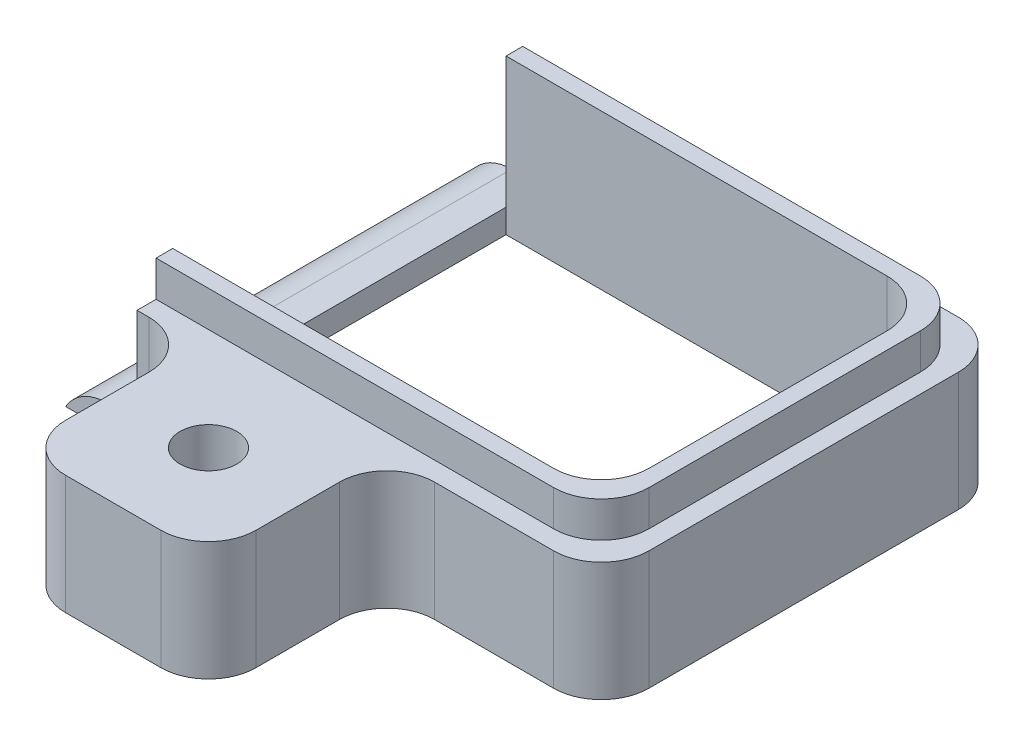
ISO-10303-21;
HEADER;
FILE_DESCRIPTION(('STEP AP214'),'2;1');
FILE_NAME('part.step','',(''),(''),'','','');
FILE_SCHEMA(('AUTOMOTIVE_DESIGN { 1 0 10303 214 1 1 1 1 }'));
ENDSEC;
DATA;
#1=APPLICATION_CONTEXT('core data for automotive mechanical design processes');
#2=APPLICATION_PROTOCOL_DEFINITION('international standard','automotive_design',2000,#1);
#3=PRODUCT_CONTEXT('',#1,'mechanical');
#4=PRODUCT('Part','Part','',(#3));
#5=PRODUCT_RELATED_PRODUCT_CATEGORY('part','',(#4));
#6=PRODUCT_DEFINITION_FORMATION('','',#4);
#7=PRODUCT_DEFINITION_CONTEXT('part definition',#1,'design');
#8=PRODUCT_DEFINITION('design','',#6,#7);
#9=PRODUCT_DEFINITION_SHAPE('','',#8);
#10=(LENGTH_UNIT() NAMED_UNIT(*) SI_UNIT(.MILLI.,.METRE.));
#11=(NAMED_UNIT(*) PLANE_ANGLE_UNIT() SI_UNIT($,.RADIAN.));
#12=(NAMED_UNIT(*) SI_UNIT($,.STERADIAN.) SOLID_ANGLE_UNIT());
#13=UNCERTAINTY_MEASURE_WITH_UNIT(LENGTH_MEASURE(1.E-05),#10,'distance_accuracy_value','');
#14=(GEOMETRIC_REPRESENTATION_CONTEXT(3) GLOBAL_UNCERTAINTY_ASSIGNED_CONTEXT((#13)) GLOBAL_UNIT_ASSIGNED_CONTEXT((#10,
#11,#12)) REPRESENTATION_CONTEXT('',''));
#15=CARTESIAN_POINT('',(0.,0.,0.));
#16=DIRECTION('',(0.,0.,1.));
#17=DIRECTION('',(1.,0.,0.));
#18=AXIS2_PLACEMENT_3D('',#15,#16,#17);
#19=CARTESIAN_POINT('',(5.62499999999999,2.5,-4.25));
#20=DIRECTION('',(0.,-1.,0.));
#21=DIRECTION('',(0.,0.,-1.));
#22=AXIS2_PLACEMENT_3D('',#19,#20,#21);
#23=PLANE('',#22);
#24=CARTESIAN_POINT('',(-0.875000000000002,2.5,6.));
#25=DIRECTION('',(0.,1.,0.));
#26=DIRECTION('',(0.,0.,1.));
#27=AXIS2_PLACEMENT_3D('',#24,#25,#26);
#28=CIRCLE('',#27,0.595629999999989);
#29=CARTESIAN_POINT('',(-0.875000000000002,2.5,6.59562999999999));
#30=VERTEX_POINT('',#29);
#31=EDGE_CURVE('E517',#30,#30,#28,.T.);
#32=ORIENTED_EDGE('',*,*,#31,.F.);
#33=EDGE_LOOP('',(#32));
#34=FACE_BOUND('',#33,.T.);
#35=DIRECTION('',(0.,0.,-1.));
#36=VECTOR('',#35,1.);
#37=CARTESIAN_POINT('',(5.625,2.5,4.25));
#38=LINE('',#37,#36);
#39=CARTESIAN_POINT('',(5.625,2.5,3.25));
#40=VERTEX_POINT('',#39);
#41=CARTESIAN_POINT('',(5.625,2.5,-3.25));
#42=VERTEX_POINT('',#41);
#43=EDGE_CURVE('E309',#40,#42,#38,.T.);
#44=ORIENTED_EDGE('',*,*,#43,.T.);
#45=CARTESIAN_POINT('',(4.625,2.5,-3.25));
#46=DIRECTION('',(0.,-1.,0.));
#47=DIRECTION('',(0.,0.,-1.));
#48=AXIS2_PLACEMENT_3D('',#45,#46,#47);
#49=CIRCLE('',#48,1.);
#50=CARTESIAN_POINT('',(4.62499999999999,2.5,-4.25));
#51=VERTEX_POINT('',#50);
#52=EDGE_CURVE('E368',#42,#51,#49,.F.);
#53=ORIENTED_EDGE('',*,*,#52,.T.);
#54=DIRECTION('',(-1.,0.,0.));
#55=VECTOR('',#54,1.);
#56=CARTESIAN_POINT('',(-5.625,2.5,-4.25));
#57=LINE('',#56,#55);
#58=CARTESIAN_POINT('',(-4.125,2.5,-4.25));
#59=VERTEX_POINT('',#58);
#60=EDGE_CURVE('E312',#51,#59,#57,.T.);
#61=ORIENTED_EDGE('',*,*,#60,.T.);
#62=DIRECTION('',(0.,0.,-1.));
#63=VECTOR('',#62,1.);
#64=CARTESIAN_POINT('',(-4.125,2.5,-4.25));
#65=LINE('',#64,#63);
#66=CARTESIAN_POINT('',(-4.125,2.5,-3.85));
#67=VERTEX_POINT('',#66);
#68=EDGE_CURVE('E295',#67,#59,#65,.T.);
#69=ORIENTED_EDGE('',*,*,#68,.F.);
#70=DIRECTION('',(-1.,0.,0.));
#71=VECTOR('',#70,1.);
#72=CARTESIAN_POINT('',(5.225,2.5,-3.85));
#73=LINE('',#72,#71);
#74=CARTESIAN_POINT('',(4.225,2.5,-3.85));
#75=VERTEX_POINT('',#74);
#76=EDGE_CURVE('E266',#75,#67,#73,.T.);
#77=ORIENTED_EDGE('',*,*,#76,.F.);
#78=CARTESIAN_POINT('',(4.225,2.5,-2.85));
#79=DIRECTION('',(0.,-1.,0.));
#80=DIRECTION('',(0.,0.,-1.));
#81=AXIS2_PLACEMENT_3D('',#78,#79,#80);
#82=CIRCLE('',#81,1.);
#83=CARTESIAN_POINT('',(5.225,2.5,-2.85));
#84=VERTEX_POINT('',#83);
#85=EDGE_CURVE('E416',#75,#84,#82,.T.);
#86=ORIENTED_EDGE('',*,*,#85,.T.);
#87=DIRECTION('',(0.,0.,-1.));
#88=VECTOR('',#87,1.);
#89=CARTESIAN_POINT('',(5.225,2.5,3.85));
#90=LINE('',#89,#88);
#91=CARTESIAN_POINT('',(5.225,2.5,2.85));
#92=VERTEX_POINT('',#91);
#93=EDGE_CURVE('E263',#92,#84,#90,.T.);
#94=ORIENTED_EDGE('',*,*,#93,.F.);
#95=CARTESIAN_POINT('',(4.225,2.5,2.85));
#96=DIRECTION('',(0.,-1.,0.));
#97=DIRECTION('',(0.,0.,-1.));
#98=AXIS2_PLACEMENT_3D('',#95,#96,#97);
#99=CIRCLE('',#98,1.);
#100=CARTESIAN_POINT('',(4.225,2.5,3.85));
#101=VERTEX_POINT('',#100);
#102=EDGE_CURVE('E418',#92,#101,#99,.T.);
#103=ORIENTED_EDGE('',*,*,#102,.T.);
#104=DIRECTION('',(1.,0.,0.));
#105=VECTOR('',#104,1.);
#106=CARTESIAN_POINT('',(-4.125,2.5,3.85));
#107=LINE('',#106,#105);
#108=CARTESIAN_POINT('',(-4.125,2.5,3.85));
#109=VERTEX_POINT('',#108);
#110=EDGE_CURVE('E267',#109,#101,#107,.T.);
#111=ORIENTED_EDGE('',*,*,#110,.F.);
#112=CARTESIAN_POINT('',(-4.125,2.5,4.25));
#113=VERTEX_POINT('',#112);
#114=EDGE_CURVE('E291',#113,#109,#65,.T.);
#115=ORIENTED_EDGE('',*,*,#114,.F.);
#116=DIRECTION('',(1.,0.,0.));
#117=VECTOR('',#116,1.);
#118=CARTESIAN_POINT('',(-5.625,2.5,4.25));
#119=LINE('',#118,#117);
#120=CARTESIAN_POINT('',(-3.875,2.5,4.25));
#121=VERTEX_POINT('',#120);
#122=EDGE_CURVE('E322',#113,#121,#119,.T.);
#123=ORIENTED_EDGE('',*,*,#122,.T.);
#124=CARTESIAN_POINT('',(-3.875,2.5,5.25));
#125=DIRECTION('',(0.,-1.,0.));
#126=DIRECTION('',(0.,0.,-1.));
#127=AXIS2_PLACEMENT_3D('',#124,#125,#126);
#128=CIRCLE('',#127,1.);
#129=CARTESIAN_POINT('',(-2.875,2.5,5.25));
#130=VERTEX_POINT('',#129);
#131=EDGE_CURVE('E426',#121,#130,#128,.T.);
#132=ORIENTED_EDGE('',*,*,#131,.T.);
#133=DIRECTION('',(0.,0.,-1.));
#134=VECTOR('',#133,1.);
#135=CARTESIAN_POINT('',(-2.875,2.5,8.));
#136=LINE('',#135,#134);
#137=CARTESIAN_POINT('',(-2.875,2.5,7.));
#138=VERTEX_POINT('',#137);
#139=EDGE_CURVE('E278',#138,#130,#136,.T.);
#140=ORIENTED_EDGE('',*,*,#139,.F.);
#141=CARTESIAN_POINT('',(-1.875,2.5,7.));
#142=DIRECTION('',(0.,-1.,0.));
#143=DIRECTION('',(0.,0.,-1.));
#144=AXIS2_PLACEMENT_3D('',#141,#142,#143);
#145=CIRCLE('',#144,1.);
#146=CARTESIAN_POINT('',(-1.875,2.5,8.));
#147=VERTEX_POINT('',#146);
#148=EDGE_CURVE('E359',#138,#147,#145,.F.);
#149=ORIENTED_EDGE('',*,*,#148,.T.);
#150=DIRECTION('',(-1.,0.,0.));
#151=VECTOR('',#150,1.);
#152=CARTESIAN_POINT('',(-2.875,2.5,8.));
#153=LINE('',#152,#151);
#154=CARTESIAN_POINT('',(0.124999999999998,2.5,8.));
#155=VERTEX_POINT('',#154);
#156=EDGE_CURVE('E283',#155,#147,#153,.T.);
#157=ORIENTED_EDGE('',*,*,#156,.F.);
#158=CARTESIAN_POINT('',(0.124999999999998,2.5,7.));
#159=DIRECTION('',(0.,-1.,0.));
#160=DIRECTION('',(0.,0.,-1.));
#161=AXIS2_PLACEMENT_3D('',#158,#159,#160);
#162=CIRCLE('',#161,1.);
#163=CARTESIAN_POINT('',(1.125,2.5,7.));
#164=VERTEX_POINT('',#163);
#165=EDGE_CURVE('E357',#155,#164,#162,.F.);
#166=ORIENTED_EDGE('',*,*,#165,.T.);
#167=DIRECTION('',(0.,0.,-1.));
#168=VECTOR('',#167,1.);
#169=CARTESIAN_POINT('',(1.125,2.5,8.));
#170=LINE('',#169,#168);
#171=CARTESIAN_POINT('',(1.125,2.5,5.25));
#172=VERTEX_POINT('',#171);
#173=EDGE_CURVE('E282',#164,#172,#170,.T.);
#174=ORIENTED_EDGE('',*,*,#173,.T.);
#175=CARTESIAN_POINT('',(2.125,2.5,5.25));
#176=DIRECTION('',(0.,-1.,0.));
#177=DIRECTION('',(0.,0.,-1.));
#178=AXIS2_PLACEMENT_3D('',#175,#176,#177);
#179=CIRCLE('',#178,1.);
#180=CARTESIAN_POINT('',(2.125,2.5,4.25));
#181=VERTEX_POINT('',#180);
#182=EDGE_CURVE('E420',#172,#181,#179,.T.);
#183=ORIENTED_EDGE('',*,*,#182,.T.);
#184=CARTESIAN_POINT('',(4.62499999999999,2.5,4.25));
#185=VERTEX_POINT('',#184);
#186=EDGE_CURVE('E315',#181,#185,#119,.T.);
#187=ORIENTED_EDGE('',*,*,#186,.T.);
#188=CARTESIAN_POINT('',(4.625,2.5,3.25));
#189=DIRECTION('',(0.,-1.,0.));
#190=DIRECTION('',(0.,0.,-1.));
#191=AXIS2_PLACEMENT_3D('',#188,#189,#190);
#192=CIRCLE('',#191,1.);
#193=EDGE_CURVE('E364',#185,#40,#192,.F.);
#194=ORIENTED_EDGE('',*,*,#193,.T.);
#195=EDGE_LOOP('',(#44,#53,#61,#69,#77,#86,#94,#103,#111,#115,#123,#132,#140,#149,#157,#166,
#174,#183,#187,#194));
#196=FACE_BOUND('',#195,.T.);
#197=ADVANCED_FACE('F31',(#34,#196),#23,.F.);
#198=CARTESIAN_POINT('',(-5.625,2.5,4.25));
#199=DIRECTION('',(0.,0.,-1.));
#200=DIRECTION('',(-1.,0.,0.));
#201=AXIS2_PLACEMENT_3D('',#198,#199,#200);
#202=PLANE('',#201);
#203=DIRECTION('',(1.,0.,0.));
#204=VECTOR('',#203,1.);
#205=CARTESIAN_POINT('',(-5.625,0.5,4.25));
#206=LINE('',#205,#204);
#207=CARTESIAN_POINT('',(-4.75897459621556,0.5,4.25));
#208=VERTEX_POINT('',#207);
#209=CARTESIAN_POINT('',(-4.125,0.5,4.25));
#210=VERTEX_POINT('',#209);
#211=EDGE_CURVE('E294',#208,#210,#206,.T.);
#212=ORIENTED_EDGE('',*,*,#211,.F.);
#213=CARTESIAN_POINT('',(-4.75897459621556,-0.5,4.25));
#214=DIRECTION('',(0.,0.,-1.));
#215=DIRECTION('',(-1.,0.,0.));
#216=AXIS2_PLACEMENT_3D('',#213,#214,#215);
#217=CIRCLE('',#216,1.);
#218=CARTESIAN_POINT('',(-5.625,0.,4.25));
#219=VERTEX_POINT('',#218);
#220=EDGE_CURVE('E39',#208,#219,#217,.F.);
#221=ORIENTED_EDGE('',*,*,#220,.T.);
#222=DIRECTION('',(1.,0.,0.));
#223=VECTOR('',#222,1.);
#224=CARTESIAN_POINT('',(-5.625,0.,4.25));
#225=LINE('',#224,#223);
#226=CARTESIAN_POINT('',(-3.875,0.,4.25));
#227=VERTEX_POINT('',#226);
#228=EDGE_CURVE('E313',#219,#227,#225,.T.);
#229=ORIENTED_EDGE('',*,*,#228,.T.);
#230=DIRECTION('',(0.,-1.,0.));
#231=VECTOR('',#230,1.);
#232=CARTESIAN_POINT('',(-3.875,2.5,4.25));
#233=LINE('',#232,#231);
#234=EDGE_CURVE('E404',#227,#121,#233,.F.);
#235=ORIENTED_EDGE('',*,*,#234,.T.);
#236=ORIENTED_EDGE('',*,*,#122,.F.);
#237=DIRECTION('',(0.,1.,0.));
#238=VECTOR('',#237,1.);
#239=CARTESIAN_POINT('',(-4.125,0.5,4.25));
#240=LINE('',#239,#238);
#241=EDGE_CURVE('E307',#210,#113,#240,.T.);
#242=ORIENTED_EDGE('',*,*,#241,.F.);
#243=EDGE_LOOP('',(#212,#221,#229,#235,#236,#242));
#244=FACE_BOUND('',#243,.T.);
#245=ADVANCED_FACE('F439',(#244),#202,.F.);
#246=CARTESIAN_POINT('',(2.125,0.,4.25));
#247=VERTEX_POINT('',#246);
#248=CARTESIAN_POINT('',(4.62499999999999,0.,4.25));
#249=VERTEX_POINT('',#248);
#250=EDGE_CURVE('E330',#247,#249,#225,.T.);
#251=ORIENTED_EDGE('',*,*,#250,.T.);
#252=DIRECTION('',(0.,-1.,0.));
#253=VECTOR('',#252,1.);
#254=CARTESIAN_POINT('',(4.625,2.5,4.25));
#255=LINE('',#254,#253);
#256=EDGE_CURVE('E384',#249,#185,#255,.F.);
#257=ORIENTED_EDGE('',*,*,#256,.T.);
#258=ORIENTED_EDGE('',*,*,#186,.F.);
#259=DIRECTION('',(0.,1.,0.));
#260=VECTOR('',#259,1.);
#261=CARTESIAN_POINT('',(2.125,0.,4.25));
#262=LINE('',#261,#260);
#263=EDGE_CURVE('E382',#181,#247,#262,.F.);
#264=ORIENTED_EDGE('',*,*,#263,.T.);
#265=EDGE_LOOP('',(#251,#257,#258,#264));
#266=FACE_BOUND('',#265,.T.);
#267=ADVANCED_FACE('F568',(#266),#202,.F.);
#268=CARTESIAN_POINT('',(-4.125,0.5,-4.25));
#269=DIRECTION('',(1.,0.,0.));
#270=DIRECTION('',(0.,0.,-1.));
#271=AXIS2_PLACEMENT_3D('',#268,#269,#270);
#272=PLANE('',#271);
#273=ORIENTED_EDGE('',*,*,#114,.T.);
#274=DIRECTION('',(0.,-1.,0.));
#275=VECTOR('',#274,1.);
#276=CARTESIAN_POINT('',(-4.125,3.25,3.85));
#277=LINE('',#276,#275);
#278=CARTESIAN_POINT('',(-4.125,3.25,3.85));
#279=VERTEX_POINT('',#278);
#280=EDGE_CURVE('E248',#279,#109,#277,.T.);
#281=ORIENTED_EDGE('',*,*,#280,.F.);
#282=DIRECTION('',(0.,0.,1.));
#283=VECTOR('',#282,1.);
#284=CARTESIAN_POINT('',(-4.125,3.25,3.5));
#285=LINE('',#284,#283);
#286=CARTESIAN_POINT('',(-4.125,3.25,3.5));
#287=VERTEX_POINT('',#286);
#288=EDGE_CURVE('E226',#287,#279,#285,.T.);
#289=ORIENTED_EDGE('',*,*,#288,.F.);
#290=DIRECTION('',(0.,1.,0.));
#291=VECTOR('',#290,1.);
#292=CARTESIAN_POINT('',(-4.125,0.,3.5));
#293=LINE('',#292,#291);
#294=CARTESIAN_POINT('',(-4.125,0.5,3.5));
#295=VERTEX_POINT('',#294);
#296=EDGE_CURVE('E236',#295,#287,#293,.T.);
#297=ORIENTED_EDGE('',*,*,#296,.F.);
#298=DIRECTION('',(0.,0.,-1.));
#299=VECTOR('',#298,1.);
#300=CARTESIAN_POINT('',(-4.125,0.5,-4.25));
#301=LINE('',#300,#299);
#302=EDGE_CURVE('E475',#210,#295,#301,.T.);
#303=ORIENTED_EDGE('',*,*,#302,.F.);
#304=ORIENTED_EDGE('',*,*,#241,.T.);
#305=EDGE_LOOP('',(#273,#281,#289,#297,#303,#304));
#306=FACE_BOUND('',#305,.T.);
#307=ADVANCED_FACE('F246',(#306),#272,.F.);
#308=CARTESIAN_POINT('',(5.625,2.5,4.25));
#309=DIRECTION('',(-1.,0.,0.));
#310=DIRECTION('',(0.,0.,1.));
#311=AXIS2_PLACEMENT_3D('',#308,#309,#310);
#312=PLANE('',#311);
#313=DIRECTION('',(0.,0.,-1.));
#314=VECTOR('',#313,1.);
#315=CARTESIAN_POINT('',(5.625,0.,4.25));
#316=LINE('',#315,#314);
#317=CARTESIAN_POINT('',(5.625,0.,3.25));
#318=VERTEX_POINT('',#317);
#319=CARTESIAN_POINT('',(5.625,0.,-3.25));
#320=VERTEX_POINT('',#319);
#321=EDGE_CURVE('E306',#318,#320,#316,.T.);
#322=ORIENTED_EDGE('',*,*,#321,.T.);
#323=DIRECTION('',(0.,-1.,0.));
#324=VECTOR('',#323,1.);
#325=CARTESIAN_POINT('',(5.625,2.5,-3.25));
#326=LINE('',#325,#324);
#327=EDGE_CURVE('E276',#320,#42,#326,.F.);
#328=ORIENTED_EDGE('',*,*,#327,.T.);
#329=ORIENTED_EDGE('',*,*,#43,.F.);
#330=DIRECTION('',(0.,-1.,0.));
#331=VECTOR('',#330,1.);
#332=CARTESIAN_POINT('',(5.625,2.5,3.25));
#333=LINE('',#332,#331);
#334=EDGE_CURVE('E350',#40,#318,#333,.T.);
#335=ORIENTED_EDGE('',*,*,#334,.T.);
#336=EDGE_LOOP('',(#322,#328,#329,#335));
#337=FACE_BOUND('',#336,.T.);
#338=ADVANCED_FACE('F450',(#337),#312,.F.);
#339=CARTESIAN_POINT('',(-5.625,2.5,-4.25));
#340=DIRECTION('',(0.,0.,1.));
#341=DIRECTION('',(1.,0.,0.));
#342=AXIS2_PLACEMENT_3D('',#339,#340,#341);
#343=PLANE('',#342);
#344=DIRECTION('',(-1.,0.,0.));
#345=VECTOR('',#344,1.);
#346=CARTESIAN_POINT('',(-5.625,0.,-4.25));
#347=LINE('',#346,#345);
#348=CARTESIAN_POINT('',(4.62499999999999,0.,-4.25));
#349=VERTEX_POINT('',#348);
#350=CARTESIAN_POINT('',(-5.625,0.,-4.25));
#351=VERTEX_POINT('',#350);
#352=EDGE_CURVE('E447',#349,#351,#347,.T.);
#353=ORIENTED_EDGE('',*,*,#352,.T.);
#354=CARTESIAN_POINT('',(-4.75897459621556,-0.5,-4.25));
#355=DIRECTION('',(0.,0.,1.));
#356=DIRECTION('',(1.,0.,0.));
#357=AXIS2_PLACEMENT_3D('',#354,#355,#356);
#358=CIRCLE('',#357,1.);
#359=CARTESIAN_POINT('',(-4.75897459621556,0.5,-4.25));
#360=VERTEX_POINT('',#359);
#361=EDGE_CURVE('E11',#351,#360,#358,.F.);
#362=ORIENTED_EDGE('',*,*,#361,.T.);
#363=DIRECTION('',(-1.,0.,0.));
#364=VECTOR('',#363,1.);
#365=CARTESIAN_POINT('',(-5.625,0.5,-4.25));
#366=LINE('',#365,#364);
#367=CARTESIAN_POINT('',(-4.125,0.5,-4.25));
#368=VERTEX_POINT('',#367);
#369=EDGE_CURVE('E300',#368,#360,#366,.T.);
#370=ORIENTED_EDGE('',*,*,#369,.F.);
#371=DIRECTION('',(0.,1.,0.));
#372=VECTOR('',#371,1.);
#373=CARTESIAN_POINT('',(-4.125,0.5,-4.25));
#374=LINE('',#373,#372);
#375=EDGE_CURVE('E302',#368,#59,#374,.T.);
#376=ORIENTED_EDGE('',*,*,#375,.T.);
#377=ORIENTED_EDGE('',*,*,#60,.F.);
#378=DIRECTION('',(0.,-1.,0.));
#379=VECTOR('',#378,1.);
#380=CARTESIAN_POINT('',(4.625,2.5,-4.25));
#381=LINE('',#380,#379);
#382=EDGE_CURVE('E326',#51,#349,#381,.T.);
#383=ORIENTED_EDGE('',*,*,#382,.T.);
#384=EDGE_LOOP('',(#353,#362,#370,#376,#377,#383));
#385=FACE_BOUND('',#384,.T.);
#386=ADVANCED_FACE('F458',(#385),#343,.F.);
#387=CARTESIAN_POINT('',(5.62499999999999,0.,-4.25));
#388=DIRECTION('',(0.,-1.,0.));
#389=DIRECTION('',(0.,0.,-1.));
#390=AXIS2_PLACEMENT_3D('',#387,#388,#389);
#391=PLANE('',#390);
#392=CARTESIAN_POINT('',(-0.875000000000002,0.,6.));
#393=DIRECTION('',(0.,-1.,0.));
#394=DIRECTION('',(0.,0.,-1.));
#395=AXIS2_PLACEMENT_3D('',#392,#393,#394);
#396=CIRCLE('',#395,0.595629999999984);
#397=CARTESIAN_POINT('',(-0.875000000000002,0.,5.40437000000002));
#398=VERTEX_POINT('',#397);
#399=EDGE_CURVE('E515',#398,#398,#396,.T.);
#400=ORIENTED_EDGE('',*,*,#399,.F.);
#401=EDGE_LOOP('',(#400));
#402=FACE_BOUND('',#401,.T.);
#403=DIRECTION('',(1.,0.,0.));
#404=VECTOR('',#403,1.);
#405=CARTESIAN_POINT('',(4.875,0.,3.5));
#406=LINE('',#405,#404);
#407=CARTESIAN_POINT('',(-4.125,0.,3.5));
#408=VERTEX_POINT('',#407);
#409=CARTESIAN_POINT('',(3.875,0.,3.5));
#410=VERTEX_POINT('',#409);
#411=EDGE_CURVE('E471',#408,#410,#406,.T.);
#412=ORIENTED_EDGE('',*,*,#411,.T.);
#413=CARTESIAN_POINT('',(3.875,0.,2.5));
#414=DIRECTION('',(0.,-1.,0.));
#415=DIRECTION('',(0.,0.,-1.));
#416=AXIS2_PLACEMENT_3D('',#413,#414,#415);
#417=CIRCLE('',#416,1.);
#418=CARTESIAN_POINT('',(4.875,0.,2.5));
#419=VERTEX_POINT('',#418);
#420=EDGE_CURVE('E429',#410,#419,#417,.F.);
#421=ORIENTED_EDGE('',*,*,#420,.T.);
#422=DIRECTION('',(0.,0.,-1.));
#423=VECTOR('',#422,1.);
#424=CARTESIAN_POINT('',(4.875,0.,-3.5));
#425=LINE('',#424,#423);
#426=CARTESIAN_POINT('',(4.875,0.,-2.5));
#427=VERTEX_POINT('',#426);
#428=EDGE_CURVE('E342',#419,#427,#425,.T.);
#429=ORIENTED_EDGE('',*,*,#428,.T.);
#430=CARTESIAN_POINT('',(3.875,0.,-2.5));
#431=DIRECTION('',(0.,-1.,0.));
#432=DIRECTION('',(0.,0.,-1.));
#433=AXIS2_PLACEMENT_3D('',#430,#431,#432);
#434=CIRCLE('',#433,1.);
#435=CARTESIAN_POINT('',(3.875,0.,-3.5));
#436=VERTEX_POINT('',#435);
#437=EDGE_CURVE('E433',#427,#436,#434,.F.);
#438=ORIENTED_EDGE('',*,*,#437,.T.);
#439=DIRECTION('',(-1.,0.,0.));
#440=VECTOR('',#439,1.);
#441=CARTESIAN_POINT('',(4.875,0.,-3.5));
#442=LINE('',#441,#440);
#443=CARTESIAN_POINT('',(-4.125,0.,-3.5));
#444=VERTEX_POINT('',#443);
#445=EDGE_CURVE('E494',#436,#444,#442,.T.);
#446=ORIENTED_EDGE('',*,*,#445,.T.);
#447=DIRECTION('',(0.,0.,1.));
#448=VECTOR('',#447,1.);
#449=CARTESIAN_POINT('',(-4.125,0.,-3.5));
#450=LINE('',#449,#448);
#451=EDGE_CURVE('E485',#444,#408,#450,.T.);
#452=ORIENTED_EDGE('',*,*,#451,.T.);
#453=EDGE_LOOP('',(#412,#421,#429,#438,#446,#452));
#454=FACE_BOUND('',#453,.T.);
#455=ORIENTED_EDGE('',*,*,#352,.F.);
#456=CARTESIAN_POINT('',(4.625,0.,-3.25));
#457=DIRECTION('',(0.,-1.,0.));
#458=DIRECTION('',(0.,0.,-1.));
#459=AXIS2_PLACEMENT_3D('',#456,#457,#458);
#460=CIRCLE('',#459,1.);
#461=EDGE_CURVE('E349',#349,#320,#460,.T.);
#462=ORIENTED_EDGE('',*,*,#461,.T.);
#463=ORIENTED_EDGE('',*,*,#321,.F.);
#464=CARTESIAN_POINT('',(4.625,0.,3.25));
#465=DIRECTION('',(0.,-1.,0.));
#466=DIRECTION('',(0.,0.,-1.));
#467=AXIS2_PLACEMENT_3D('',#464,#465,#466);
#468=CIRCLE('',#467,1.);
#469=EDGE_CURVE('E347',#318,#249,#468,.T.);
#470=ORIENTED_EDGE('',*,*,#469,.T.);
#471=ORIENTED_EDGE('',*,*,#250,.F.);
#472=CARTESIAN_POINT('',(2.125,0.,5.25));
#473=DIRECTION('',(0.,-1.,0.));
#474=DIRECTION('',(0.,0.,-1.));
#475=AXIS2_PLACEMENT_3D('',#472,#473,#474);
#476=CIRCLE('',#475,1.);
#477=CARTESIAN_POINT('',(1.125,0.,5.25));
#478=VERTEX_POINT('',#477);
#479=EDGE_CURVE('E422',#247,#478,#476,.F.);
#480=ORIENTED_EDGE('',*,*,#479,.T.);
#481=DIRECTION('',(0.,0.,-1.));
#482=VECTOR('',#481,1.);
#483=CARTESIAN_POINT('',(1.125,0.,8.));
#484=LINE('',#483,#482);
#485=CARTESIAN_POINT('',(1.125,0.,7.));
#486=VERTEX_POINT('',#485);
#487=EDGE_CURVE('E334',#486,#478,#484,.T.);
#488=ORIENTED_EDGE('',*,*,#487,.F.);
#489=CARTESIAN_POINT('',(0.124999999999998,0.,7.));
#490=DIRECTION('',(0.,-1.,0.));
#491=DIRECTION('',(0.,0.,-1.));
#492=AXIS2_PLACEMENT_3D('',#489,#490,#491);
#493=CIRCLE('',#492,1.);
#494=CARTESIAN_POINT('',(0.124999999999998,0.,8.));
#495=VERTEX_POINT('',#494);
#496=EDGE_CURVE('E343',#486,#495,#493,.T.);
#497=ORIENTED_EDGE('',*,*,#496,.T.);
#498=DIRECTION('',(1.,0.,0.));
#499=VECTOR('',#498,1.);
#500=CARTESIAN_POINT('',(-2.875,0.,8.));
#501=LINE('',#500,#499);
#502=CARTESIAN_POINT('',(-1.875,0.,8.));
#503=VERTEX_POINT('',#502);
#504=EDGE_CURVE('E270',#503,#495,#501,.T.);
#505=ORIENTED_EDGE('',*,*,#504,.F.);
#506=CARTESIAN_POINT('',(-1.875,0.,7.));
#507=DIRECTION('',(0.,-1.,0.));
#508=DIRECTION('',(0.,0.,-1.));
#509=AXIS2_PLACEMENT_3D('',#506,#507,#508);
#510=CIRCLE('',#509,1.);
#511=CARTESIAN_POINT('',(-2.875,0.,7.));
#512=VERTEX_POINT('',#511);
#513=EDGE_CURVE('E345',#503,#512,#510,.T.);
#514=ORIENTED_EDGE('',*,*,#513,.T.);
#515=DIRECTION('',(0.,0.,-1.));
#516=VECTOR('',#515,1.);
#517=CARTESIAN_POINT('',(-2.875,0.,8.));
#518=LINE('',#517,#516);
#519=CARTESIAN_POINT('',(-2.875,0.,5.25));
#520=VERTEX_POINT('',#519);
#521=EDGE_CURVE('E338',#512,#520,#518,.T.);
#522=ORIENTED_EDGE('',*,*,#521,.T.);
#523=CARTESIAN_POINT('',(-3.875,0.,5.25));
#524=DIRECTION('',(0.,-1.,0.));
#525=DIRECTION('',(0.,0.,-1.));
#526=AXIS2_PLACEMENT_3D('',#523,#524,#525);
#527=CIRCLE('',#526,1.);
#528=EDGE_CURVE('E424',#520,#227,#527,.F.);
#529=ORIENTED_EDGE('',*,*,#528,.T.);
#530=ORIENTED_EDGE('',*,*,#228,.F.);
#531=DIRECTION('',(0.,0.,1.));
#532=VECTOR('',#531,1.);
#533=CARTESIAN_POINT('',(-5.625,0.,4.25));
#534=LINE('',#533,#532);
#535=EDGE_CURVE('E446',#351,#219,#534,.T.);
#536=ORIENTED_EDGE('',*,*,#535,.F.);
#537=EDGE_LOOP('',(#455,#462,#463,#470,#471,#480,#488,#497,#505,#514,#522,#529,#530,#536));
#538=FACE_BOUND('',#537,.T.);
#539=ADVANCED_FACE('F445',(#402,#454,#538),#391,.T.);
#540=CARTESIAN_POINT('',(-4.125,0.5,-3.5));
#541=VERTEX_POINT('',#540);
#542=EDGE_CURVE('E463',#541,#368,#301,.T.);
#543=ORIENTED_EDGE('',*,*,#542,.F.);
#544=DIRECTION('',(0.,1.,0.));
#545=VECTOR('',#544,1.);
#546=CARTESIAN_POINT('',(-4.125,0.,-3.5));
#547=LINE('',#546,#545);
#548=CARTESIAN_POINT('',(-4.125,3.25,-3.5));
#549=VERTEX_POINT('',#548);
#550=EDGE_CURVE('E474',#541,#549,#547,.T.);
#551=ORIENTED_EDGE('',*,*,#550,.T.);
#552=DIRECTION('',(0.,0.,1.));
#553=VECTOR('',#552,1.);
#554=CARTESIAN_POINT('',(-4.125,3.25,-3.85));
#555=LINE('',#554,#553);
#556=CARTESIAN_POINT('',(-4.125,3.25,-3.85));
#557=VERTEX_POINT('',#556);
#558=EDGE_CURVE('E259',#557,#549,#555,.T.);
#559=ORIENTED_EDGE('',*,*,#558,.F.);
#560=DIRECTION('',(0.,-1.,0.));
#561=VECTOR('',#560,1.);
#562=CARTESIAN_POINT('',(-4.125,3.25,-3.85));
#563=LINE('',#562,#561);
#564=EDGE_CURVE('E262',#557,#67,#563,.T.);
#565=ORIENTED_EDGE('',*,*,#564,.T.);
#566=ORIENTED_EDGE('',*,*,#68,.T.);
#567=ORIENTED_EDGE('',*,*,#375,.F.);
#568=EDGE_LOOP('',(#543,#551,#559,#565,#566,#567));
#569=FACE_BOUND('',#568,.T.);
#570=ADVANCED_FACE('F462',(#569),#272,.F.);
#571=CARTESIAN_POINT('',(-5.625,0.5,4.25));
#572=DIRECTION('',(0.,1.,0.));
#573=DIRECTION('',(0.,0.,1.));
#574=AXIS2_PLACEMENT_3D('',#571,#572,#573);
#575=PLANE('',#574);
#576=ORIENTED_EDGE('',*,*,#369,.T.);
#577=DIRECTION('',(0.,0.,1.));
#578=VECTOR('',#577,1.);
#579=CARTESIAN_POINT('',(-4.75897459621556,0.5,4.25));
#580=LINE('',#579,#578);
#581=EDGE_CURVE('E435',#360,#208,#580,.T.);
#582=ORIENTED_EDGE('',*,*,#581,.T.);
#583=ORIENTED_EDGE('',*,*,#211,.T.);
#584=ORIENTED_EDGE('',*,*,#302,.T.);
#585=EDGE_CURVE('E476',#295,#541,#301,.T.);
#586=ORIENTED_EDGE('',*,*,#585,.T.);
#587=ORIENTED_EDGE('',*,*,#542,.T.);
#588=EDGE_LOOP('',(#576,#582,#583,#584,#586,#587));
#589=FACE_BOUND('',#588,.T.);
#590=ADVANCED_FACE('F478',(#589),#575,.T.);
#591=CARTESIAN_POINT('',(4.875,0.,-3.5));
#592=DIRECTION('',(1.,0.,0.));
#593=DIRECTION('',(0.,0.,-1.));
#594=AXIS2_PLACEMENT_3D('',#591,#592,#593);
#595=PLANE('',#594);
#596=ORIENTED_EDGE('',*,*,#428,.F.);
#597=DIRECTION('',(0.,1.,0.));
#598=VECTOR('',#597,1.);
#599=CARTESIAN_POINT('',(4.875,3.25,2.5));
#600=LINE('',#599,#598);
#601=CARTESIAN_POINT('',(4.875,3.25,2.5));
#602=VERTEX_POINT('',#601);
#603=EDGE_CURVE('E408',#419,#602,#600,.T.);
#604=ORIENTED_EDGE('',*,*,#603,.T.);
#605=DIRECTION('',(0.,0.,1.));
#606=VECTOR('',#605,1.);
#607=CARTESIAN_POINT('',(4.875,3.25,-3.5));
#608=LINE('',#607,#606);
#609=CARTESIAN_POINT('',(4.875,3.25,-2.5));
#610=VERTEX_POINT('',#609);
#611=EDGE_CURVE('E232',#610,#602,#608,.T.);
#612=ORIENTED_EDGE('',*,*,#611,.F.);
#613=DIRECTION('',(0.,1.,0.));
#614=VECTOR('',#613,1.);
#615=CARTESIAN_POINT('',(4.875,0.,-2.5));
#616=LINE('',#615,#614);
#617=EDGE_CURVE('E406',#610,#427,#616,.F.);
#618=ORIENTED_EDGE('',*,*,#617,.T.);
#619=EDGE_LOOP('',(#596,#604,#612,#618));
#620=FACE_BOUND('',#619,.T.);
#621=ADVANCED_FACE('F529',(#620),#595,.F.);
#622=CARTESIAN_POINT('',(4.875,0.,3.5));
#623=DIRECTION('',(0.,0.,1.));
#624=DIRECTION('',(1.,0.,0.));
#625=AXIS2_PLACEMENT_3D('',#622,#623,#624);
#626=PLANE('',#625);
#627=DIRECTION('',(-1.,0.,0.));
#628=VECTOR('',#627,1.);
#629=CARTESIAN_POINT('',(4.875,3.25,3.5));
#630=LINE('',#629,#628);
#631=CARTESIAN_POINT('',(3.875,3.25,3.5));
#632=VERTEX_POINT('',#631);
#633=EDGE_CURVE('E220',#632,#287,#630,.T.);
#634=ORIENTED_EDGE('',*,*,#633,.F.);
#635=DIRECTION('',(0.,1.,0.));
#636=VECTOR('',#635,1.);
#637=CARTESIAN_POINT('',(3.875,0.,3.5));
#638=LINE('',#637,#636);
#639=EDGE_CURVE('E411',#632,#410,#638,.F.);
#640=ORIENTED_EDGE('',*,*,#639,.T.);
#641=ORIENTED_EDGE('',*,*,#411,.F.);
#642=EDGE_CURVE('E239',#408,#295,#293,.T.);
#643=ORIENTED_EDGE('',*,*,#642,.T.);
#644=ORIENTED_EDGE('',*,*,#296,.T.);
#645=EDGE_LOOP('',(#634,#640,#641,#643,#644));
#646=FACE_BOUND('',#645,.T.);
#647=ADVANCED_FACE('F237',(#646),#626,.F.);
#648=CARTESIAN_POINT('',(-4.125,0.,-3.5));
#649=DIRECTION('',(-1.,0.,0.));
#650=DIRECTION('',(0.,0.,1.));
#651=AXIS2_PLACEMENT_3D('',#648,#649,#650);
#652=PLANE('',#651);
#653=ORIENTED_EDGE('',*,*,#585,.F.);
#654=ORIENTED_EDGE('',*,*,#642,.F.);
#655=ORIENTED_EDGE('',*,*,#451,.F.);
#656=EDGE_CURVE('E243',#444,#541,#547,.T.);
#657=ORIENTED_EDGE('',*,*,#656,.T.);
#658=EDGE_LOOP('',(#653,#654,#655,#657));
#659=FACE_BOUND('',#658,.T.);
#660=ADVANCED_FACE('F480',(#659),#652,.F.);
#661=CARTESIAN_POINT('',(4.875,0.,-3.5));
#662=DIRECTION('',(0.,0.,-1.));
#663=DIRECTION('',(-1.,0.,0.));
#664=AXIS2_PLACEMENT_3D('',#661,#662,#663);
#665=PLANE('',#664);
#666=ORIENTED_EDGE('',*,*,#445,.F.);
#667=DIRECTION('',(0.,1.,0.));
#668=VECTOR('',#667,1.);
#669=CARTESIAN_POINT('',(3.875,3.25,-3.5));
#670=LINE('',#669,#668);
#671=CARTESIAN_POINT('',(3.875,3.25,-3.5));
#672=VERTEX_POINT('',#671);
#673=EDGE_CURVE('E413',#436,#672,#670,.T.);
#674=ORIENTED_EDGE('',*,*,#673,.T.);
#675=DIRECTION('',(1.,0.,0.));
#676=VECTOR('',#675,1.);
#677=CARTESIAN_POINT('',(-4.125,3.25,-3.5));
#678=LINE('',#677,#676);
#679=EDGE_CURVE('E275',#549,#672,#678,.T.);
#680=ORIENTED_EDGE('',*,*,#679,.F.);
#681=ORIENTED_EDGE('',*,*,#550,.F.);
#682=ORIENTED_EDGE('',*,*,#656,.F.);
#683=EDGE_LOOP('',(#666,#674,#680,#681,#682));
#684=FACE_BOUND('',#683,.T.);
#685=ADVANCED_FACE('F489',(#684),#665,.F.);
#686=CARTESIAN_POINT('',(-2.875,0.,8.));
#687=DIRECTION('',(1.,0.,0.));
#688=DIRECTION('',(0.,0.,-1.));
#689=AXIS2_PLACEMENT_3D('',#686,#687,#688);
#690=PLANE('',#689);
#691=ORIENTED_EDGE('',*,*,#521,.F.);
#692=DIRECTION('',(0.,-1.,0.));
#693=VECTOR('',#692,1.);
#694=CARTESIAN_POINT('',(-2.875,0.,7.));
#695=LINE('',#694,#693);
#696=EDGE_CURVE('E397',#512,#138,#695,.F.);
#697=ORIENTED_EDGE('',*,*,#696,.T.);
#698=ORIENTED_EDGE('',*,*,#139,.T.);
#699=DIRECTION('',(0.,-1.,0.));
#700=VECTOR('',#699,1.);
#701=CARTESIAN_POINT('',(-2.875,0.,5.25));
#702=LINE('',#701,#700);
#703=EDGE_CURVE('E394',#130,#520,#702,.T.);
#704=ORIENTED_EDGE('',*,*,#703,.T.);
#705=EDGE_LOOP('',(#691,#697,#698,#704));
#706=FACE_BOUND('',#705,.T.);
#707=ADVANCED_FACE('F599',(#706),#690,.F.);
#708=CARTESIAN_POINT('',(1.125,0.,8.));
#709=DIRECTION('',(-1.,0.,0.));
#710=DIRECTION('',(0.,0.,1.));
#711=AXIS2_PLACEMENT_3D('',#708,#709,#710);
#712=PLANE('',#711);
#713=ORIENTED_EDGE('',*,*,#173,.F.);
#714=DIRECTION('',(0.,1.,0.));
#715=VECTOR('',#714,1.);
#716=CARTESIAN_POINT('',(1.125,0.,7.));
#717=LINE('',#716,#715);
#718=EDGE_CURVE('E402',#164,#486,#717,.F.);
#719=ORIENTED_EDGE('',*,*,#718,.T.);
#720=ORIENTED_EDGE('',*,*,#487,.T.);
#721=DIRECTION('',(0.,1.,0.));
#722=VECTOR('',#721,1.);
#723=CARTESIAN_POINT('',(1.125,2.5,5.25));
#724=LINE('',#723,#722);
#725=EDGE_CURVE('E399',#478,#172,#724,.T.);
#726=ORIENTED_EDGE('',*,*,#725,.T.);
#727=EDGE_LOOP('',(#713,#719,#720,#726));
#728=FACE_BOUND('',#727,.T.);
#729=ADVANCED_FACE('F606',(#728),#712,.F.);
#730=CARTESIAN_POINT('',(-2.875,2.5,8.));
#731=DIRECTION('',(0.,0.,-1.));
#732=DIRECTION('',(-1.,0.,0.));
#733=AXIS2_PLACEMENT_3D('',#730,#731,#732);
#734=PLANE('',#733);
#735=ORIENTED_EDGE('',*,*,#156,.T.);
#736=DIRECTION('',(0.,-1.,0.));
#737=VECTOR('',#736,1.);
#738=CARTESIAN_POINT('',(-1.875,2.5,8.));
#739=LINE('',#738,#737);
#740=EDGE_CURVE('E391',#147,#503,#739,.T.);
#741=ORIENTED_EDGE('',*,*,#740,.T.);
#742=ORIENTED_EDGE('',*,*,#504,.T.);
#743=DIRECTION('',(0.,1.,0.));
#744=VECTOR('',#743,1.);
#745=CARTESIAN_POINT('',(0.124999999999998,2.5,8.));
#746=LINE('',#745,#744);
#747=EDGE_CURVE('E388',#495,#155,#746,.T.);
#748=ORIENTED_EDGE('',*,*,#747,.T.);
#749=EDGE_LOOP('',(#735,#741,#742,#748));
#750=FACE_BOUND('',#749,.T.);
#751=ADVANCED_FACE('F610',(#750),#734,.F.);
#752=CARTESIAN_POINT('',(-4.125,3.25,3.85));
#753=DIRECTION('',(0.,0.,-1.));
#754=DIRECTION('',(-1.,0.,0.));
#755=AXIS2_PLACEMENT_3D('',#752,#753,#754);
#756=PLANE('',#755);
#757=ORIENTED_EDGE('',*,*,#110,.T.);
#758=DIRECTION('',(0.,-1.,0.));
#759=VECTOR('',#758,1.);
#760=CARTESIAN_POINT('',(4.225,3.25,3.85));
#761=LINE('',#760,#759);
#762=CARTESIAN_POINT('',(4.225,3.25,3.85));
#763=VERTEX_POINT('',#762);
#764=EDGE_CURVE('E386',#101,#763,#761,.F.);
#765=ORIENTED_EDGE('',*,*,#764,.T.);
#766=DIRECTION('',(1.,0.,0.));
#767=VECTOR('',#766,1.);
#768=CARTESIAN_POINT('',(-4.125,3.25,3.85));
#769=LINE('',#768,#767);
#770=EDGE_CURVE('E250',#279,#763,#769,.T.);
#771=ORIENTED_EDGE('',*,*,#770,.F.);
#772=ORIENTED_EDGE('',*,*,#280,.T.);
#773=EDGE_LOOP('',(#757,#765,#771,#772));
#774=FACE_BOUND('',#773,.T.);
#775=ADVANCED_FACE('F614',(#774),#756,.F.);
#776=CARTESIAN_POINT('',(5.225,3.25,3.85));
#777=DIRECTION('',(-1.,0.,0.));
#778=DIRECTION('',(0.,0.,1.));
#779=AXIS2_PLACEMENT_3D('',#776,#777,#778);
#780=PLANE('',#779);
#781=ORIENTED_EDGE('',*,*,#93,.T.);
#782=DIRECTION('',(0.,-1.,0.));
#783=VECTOR('',#782,1.);
#784=CARTESIAN_POINT('',(5.225,3.25,-2.85));
#785=LINE('',#784,#783);
#786=CARTESIAN_POINT('',(5.225,3.25,-2.85));
#787=VERTEX_POINT('',#786);
#788=EDGE_CURVE('E376',#84,#787,#785,.F.);
#789=ORIENTED_EDGE('',*,*,#788,.T.);
#790=DIRECTION('',(0.,0.,-1.));
#791=VECTOR('',#790,1.);
#792=CARTESIAN_POINT('',(5.225,3.25,3.85));
#793=LINE('',#792,#791);
#794=CARTESIAN_POINT('',(5.225,3.25,2.85));
#795=VERTEX_POINT('',#794);
#796=EDGE_CURVE('E252',#795,#787,#793,.T.);
#797=ORIENTED_EDGE('',*,*,#796,.F.);
#798=DIRECTION('',(0.,-1.,0.));
#799=VECTOR('',#798,1.);
#800=CARTESIAN_POINT('',(5.225,3.25,2.85));
#801=LINE('',#800,#799);
#802=EDGE_CURVE('E373',#795,#92,#801,.T.);
#803=ORIENTED_EDGE('',*,*,#802,.T.);
#804=EDGE_LOOP('',(#781,#789,#797,#803));
#805=FACE_BOUND('',#804,.T.);
#806=ADVANCED_FACE('F544',(#805),#780,.F.);
#807=CARTESIAN_POINT('',(5.225,3.25,-3.85));
#808=DIRECTION('',(0.,0.,1.));
#809=DIRECTION('',(1.,0.,0.));
#810=AXIS2_PLACEMENT_3D('',#807,#808,#809);
#811=PLANE('',#810);
#812=DIRECTION('',(-1.,0.,0.));
#813=VECTOR('',#812,1.);
#814=CARTESIAN_POINT('',(5.225,3.25,-3.85));
#815=LINE('',#814,#813);
#816=CARTESIAN_POINT('',(4.225,3.25,-3.85));
#817=VERTEX_POINT('',#816);
#818=EDGE_CURVE('E257',#817,#557,#815,.T.);
#819=ORIENTED_EDGE('',*,*,#818,.F.);
#820=DIRECTION('',(0.,-1.,0.));
#821=VECTOR('',#820,1.);
#822=CARTESIAN_POINT('',(4.225,3.25,-3.85));
#823=LINE('',#822,#821);
#824=EDGE_CURVE('E370',#817,#75,#823,.T.);
#825=ORIENTED_EDGE('',*,*,#824,.T.);
#826=ORIENTED_EDGE('',*,*,#76,.T.);
#827=ORIENTED_EDGE('',*,*,#564,.F.);
#828=EDGE_LOOP('',(#819,#825,#826,#827));
#829=FACE_BOUND('',#828,.T.);
#830=ADVANCED_FACE('F539',(#829),#811,.F.);
#831=CARTESIAN_POINT('',(4.875,3.25,-3.5));
#832=DIRECTION('',(0.,-1.,0.));
#833=DIRECTION('',(0.,0.,-1.));
#834=AXIS2_PLACEMENT_3D('',#831,#832,#833);
#835=PLANE('',#834);
#836=ORIENTED_EDGE('',*,*,#796,.T.);
#837=CARTESIAN_POINT('',(4.225,3.25,-2.85));
#838=DIRECTION('',(0.,-1.,0.));
#839=DIRECTION('',(0.,0.,-1.));
#840=AXIS2_PLACEMENT_3D('',#837,#838,#839);
#841=CIRCLE('',#840,1.);
#842=EDGE_CURVE('E380',#787,#817,#841,.F.);
#843=ORIENTED_EDGE('',*,*,#842,.T.);
#844=ORIENTED_EDGE('',*,*,#818,.T.);
#845=ORIENTED_EDGE('',*,*,#558,.T.);
#846=ORIENTED_EDGE('',*,*,#679,.T.);
#847=CARTESIAN_POINT('',(3.875,3.25,-2.5));
#848=DIRECTION('',(0.,-1.,0.));
#849=DIRECTION('',(0.,0.,-1.));
#850=AXIS2_PLACEMENT_3D('',#847,#848,#849);
#851=CIRCLE('',#850,1.);
#852=EDGE_CURVE('E431',#672,#610,#851,.T.);
#853=ORIENTED_EDGE('',*,*,#852,.T.);
#854=ORIENTED_EDGE('',*,*,#611,.T.);
#855=CARTESIAN_POINT('',(3.875,3.25,2.5));
#856=DIRECTION('',(0.,-1.,0.));
#857=DIRECTION('',(0.,0.,-1.));
#858=AXIS2_PLACEMENT_3D('',#855,#856,#857);
#859=CIRCLE('',#858,1.);
#860=EDGE_CURVE('E229',#602,#632,#859,.T.);
#861=ORIENTED_EDGE('',*,*,#860,.T.);
#862=ORIENTED_EDGE('',*,*,#633,.T.);
#863=ORIENTED_EDGE('',*,*,#288,.T.);
#864=ORIENTED_EDGE('',*,*,#770,.T.);
#865=CARTESIAN_POINT('',(4.225,3.25,2.85));
#866=DIRECTION('',(0.,-1.,0.));
#867=DIRECTION('',(0.,0.,-1.));
#868=AXIS2_PLACEMENT_3D('',#865,#866,#867);
#869=CIRCLE('',#868,1.);
#870=EDGE_CURVE('E378',#763,#795,#869,.F.);
#871=ORIENTED_EDGE('',*,*,#870,.T.);
#872=EDGE_LOOP('',(#836,#843,#844,#845,#846,#853,#854,#861,#862,#863,#864,#871));
#873=FACE_BOUND('',#872,.T.);
#874=ADVANCED_FACE('F223',(#873),#835,.F.);
#875=CARTESIAN_POINT('',(-0.875000000000002,2.5,6.));
#876=DIRECTION('',(0.,1.,0.));
#877=DIRECTION('',(0.,0.,1.));
#878=AXIS2_PLACEMENT_3D('',#875,#876,#877);
#879=CYLINDRICAL_SURFACE('',#878,0.595629999999984);
#880=ORIENTED_EDGE('',*,*,#399,.T.);
#881=EDGE_LOOP('',(#880));
#882=FACE_BOUND('',#881,.T.);
#883=ORIENTED_EDGE('',*,*,#31,.T.);
#884=EDGE_LOOP('',(#883));
#885=FACE_BOUND('',#884,.T.);
#886=ADVANCED_FACE('F558',(#882,#885),#879,.F.);
#887=CARTESIAN_POINT('',(4.625,2.5,-3.25));
#888=DIRECTION('',(0.,-1.,0.));
#889=DIRECTION('',(0.,0.,-1.));
#890=AXIS2_PLACEMENT_3D('',#887,#888,#889);
#891=CYLINDRICAL_SURFACE('',#890,1.);
#892=ORIENTED_EDGE('',*,*,#52,.F.);
#893=ORIENTED_EDGE('',*,*,#327,.F.);
#894=ORIENTED_EDGE('',*,*,#461,.F.);
#895=ORIENTED_EDGE('',*,*,#382,.F.);
#896=EDGE_LOOP('',(#892,#893,#894,#895));
#897=FACE_BOUND('',#896,.T.);
#898=ADVANCED_FACE('F453',(#897),#891,.T.);
#899=CARTESIAN_POINT('',(4.225,3.25,-2.85));
#900=DIRECTION('',(0.,-1.,0.));
#901=DIRECTION('',(0.,0.,-1.));
#902=AXIS2_PLACEMENT_3D('',#899,#900,#901);
#903=CYLINDRICAL_SURFACE('',#902,1.);
#904=ORIENTED_EDGE('',*,*,#842,.F.);
#905=ORIENTED_EDGE('',*,*,#788,.F.);
#906=ORIENTED_EDGE('',*,*,#85,.F.);
#907=ORIENTED_EDGE('',*,*,#824,.F.);
#908=EDGE_LOOP('',(#904,#905,#906,#907));
#909=FACE_BOUND('',#908,.T.);
#910=ADVANCED_FACE('F547',(#909),#903,.T.);
#911=CARTESIAN_POINT('',(4.625,2.5,3.25));
#912=DIRECTION('',(0.,-1.,0.));
#913=DIRECTION('',(0.,0.,-1.));
#914=AXIS2_PLACEMENT_3D('',#911,#912,#913);
#915=CYLINDRICAL_SURFACE('',#914,1.);
#916=ORIENTED_EDGE('',*,*,#193,.F.);
#917=ORIENTED_EDGE('',*,*,#256,.F.);
#918=ORIENTED_EDGE('',*,*,#469,.F.);
#919=ORIENTED_EDGE('',*,*,#334,.F.);
#920=EDGE_LOOP('',(#916,#917,#918,#919));
#921=FACE_BOUND('',#920,.T.);
#922=ADVANCED_FACE('F549',(#921),#915,.T.);
#923=CARTESIAN_POINT('',(4.225,3.25,2.85));
#924=DIRECTION('',(0.,-1.,0.));
#925=DIRECTION('',(0.,0.,-1.));
#926=AXIS2_PLACEMENT_3D('',#923,#924,#925);
#927=CYLINDRICAL_SURFACE('',#926,1.);
#928=ORIENTED_EDGE('',*,*,#870,.F.);
#929=ORIENTED_EDGE('',*,*,#764,.F.);
#930=ORIENTED_EDGE('',*,*,#102,.F.);
#931=ORIENTED_EDGE('',*,*,#802,.F.);
#932=EDGE_LOOP('',(#928,#929,#930,#931));
#933=FACE_BOUND('',#932,.T.);
#934=ADVANCED_FACE('F555',(#933),#927,.T.);
#935=CARTESIAN_POINT('',(-1.875,2.5,7.));
#936=DIRECTION('',(0.,-1.,0.));
#937=DIRECTION('',(0.,0.,-1.));
#938=AXIS2_PLACEMENT_3D('',#935,#936,#937);
#939=CYLINDRICAL_SURFACE('',#938,1.);
#940=ORIENTED_EDGE('',*,*,#148,.F.);
#941=ORIENTED_EDGE('',*,*,#696,.F.);
#942=ORIENTED_EDGE('',*,*,#513,.F.);
#943=ORIENTED_EDGE('',*,*,#740,.F.);
#944=EDGE_LOOP('',(#940,#941,#942,#943));
#945=FACE_BOUND('',#944,.T.);
#946=ADVANCED_FACE('F653',(#945),#939,.T.);
#947=CARTESIAN_POINT('',(0.124999999999998,2.5,7.));
#948=DIRECTION('',(0.,1.,0.));
#949=DIRECTION('',(0.,0.,1.));
#950=AXIS2_PLACEMENT_3D('',#947,#948,#949);
#951=CYLINDRICAL_SURFACE('',#950,1.);
#952=ORIENTED_EDGE('',*,*,#496,.F.);
#953=ORIENTED_EDGE('',*,*,#718,.F.);
#954=ORIENTED_EDGE('',*,*,#165,.F.);
#955=ORIENTED_EDGE('',*,*,#747,.F.);
#956=EDGE_LOOP('',(#952,#953,#954,#955));
#957=FACE_BOUND('',#956,.T.);
#958=ADVANCED_FACE('F663',(#957),#951,.T.);
#959=CARTESIAN_POINT('',(2.125,0.,5.25));
#960=DIRECTION('',(0.,-1.,0.));
#961=DIRECTION('',(0.,0.,-1.));
#962=AXIS2_PLACEMENT_3D('',#959,#960,#961);
#963=CYLINDRICAL_SURFACE('',#962,1.);
#964=ORIENTED_EDGE('',*,*,#479,.F.);
#965=ORIENTED_EDGE('',*,*,#263,.F.);
#966=ORIENTED_EDGE('',*,*,#182,.F.);
#967=ORIENTED_EDGE('',*,*,#725,.F.);
#968=EDGE_LOOP('',(#964,#965,#966,#967));
#969=FACE_BOUND('',#968,.T.);
#970=ADVANCED_FACE('F673',(#969),#963,.F.);
#971=CARTESIAN_POINT('',(-3.875,0.,5.25));
#972=DIRECTION('',(0.,1.,0.));
#973=DIRECTION('',(0.,0.,1.));
#974=AXIS2_PLACEMENT_3D('',#971,#972,#973);
#975=CYLINDRICAL_SURFACE('',#974,1.);
#976=ORIENTED_EDGE('',*,*,#131,.F.);
#977=ORIENTED_EDGE('',*,*,#234,.F.);
#978=ORIENTED_EDGE('',*,*,#528,.F.);
#979=ORIENTED_EDGE('',*,*,#703,.F.);
#980=EDGE_LOOP('',(#976,#977,#978,#979));
#981=FACE_BOUND('',#980,.T.);
#982=ADVANCED_FACE('F683',(#981),#975,.F.);
#983=CARTESIAN_POINT('',(3.875,0.,2.5));
#984=DIRECTION('',(0.,-1.,0.));
#985=DIRECTION('',(0.,0.,-1.));
#986=AXIS2_PLACEMENT_3D('',#983,#984,#985);
#987=CYLINDRICAL_SURFACE('',#986,1.);
#988=ORIENTED_EDGE('',*,*,#420,.F.);
#989=ORIENTED_EDGE('',*,*,#639,.F.);
#990=ORIENTED_EDGE('',*,*,#860,.F.);
#991=ORIENTED_EDGE('',*,*,#603,.F.);
#992=EDGE_LOOP('',(#988,#989,#990,#991));
#993=FACE_BOUND('',#992,.T.);
#994=ADVANCED_FACE('F693',(#993),#987,.F.);
#995=CARTESIAN_POINT('',(3.875,0.,-2.5));
#996=DIRECTION('',(0.,-1.,0.));
#997=DIRECTION('',(0.,0.,-1.));
#998=AXIS2_PLACEMENT_3D('',#995,#996,#997);
#999=CYLINDRICAL_SURFACE('',#998,1.);
#1000=ORIENTED_EDGE('',*,*,#437,.F.);
#1001=ORIENTED_EDGE('',*,*,#617,.F.);
#1002=ORIENTED_EDGE('',*,*,#852,.F.);
#1003=ORIENTED_EDGE('',*,*,#673,.F.);
#1004=EDGE_LOOP('',(#1000,#1001,#1002,#1003));
#1005=FACE_BOUND('',#1004,.T.);
#1006=ADVANCED_FACE('F533',(#1005),#999,.F.);
#1007=CARTESIAN_POINT('',(-4.75897459621556,-0.5,4.25));
#1008=DIRECTION('',(0.,0.,-1.));
#1009=DIRECTION('',(-1.,0.,0.));
#1010=AXIS2_PLACEMENT_3D('',#1007,#1008,#1009);
#1011=CYLINDRICAL_SURFACE('',#1010,1.);
#1012=ORIENTED_EDGE('',*,*,#361,.F.);
#1013=ORIENTED_EDGE('',*,*,#535,.T.);
#1014=ORIENTED_EDGE('',*,*,#220,.F.);
#1015=ORIENTED_EDGE('',*,*,#581,.F.);
#1016=EDGE_LOOP('',(#1012,#1013,#1014,#1015));
#1017=FACE_BOUND('',#1016,.T.);
#1018=ADVANCED_FACE('F33',(#1017),#1011,.T.);
#1019=CLOSED_SHELL('',(#197,#245,#267,#307,#338,#386,#539,#570,#590,#621,#647,#660,#685,#707,
#729,#751,#775,#806,#830,#874,#886,#898,#910,#922,#934,#946,#958,#970,#982,#994,#1006,#1018));
#1020=MANIFOLD_SOLID_BREP('B2',#1019);
#1021=ADVANCED_BREP_SHAPE_REPRESENTATION('',(#18,#1020),#14);
#1022=SHAPE_DEFINITION_REPRESENTATION(#9,#1021);
ENDSEC;
END-ISO-10303-21;
